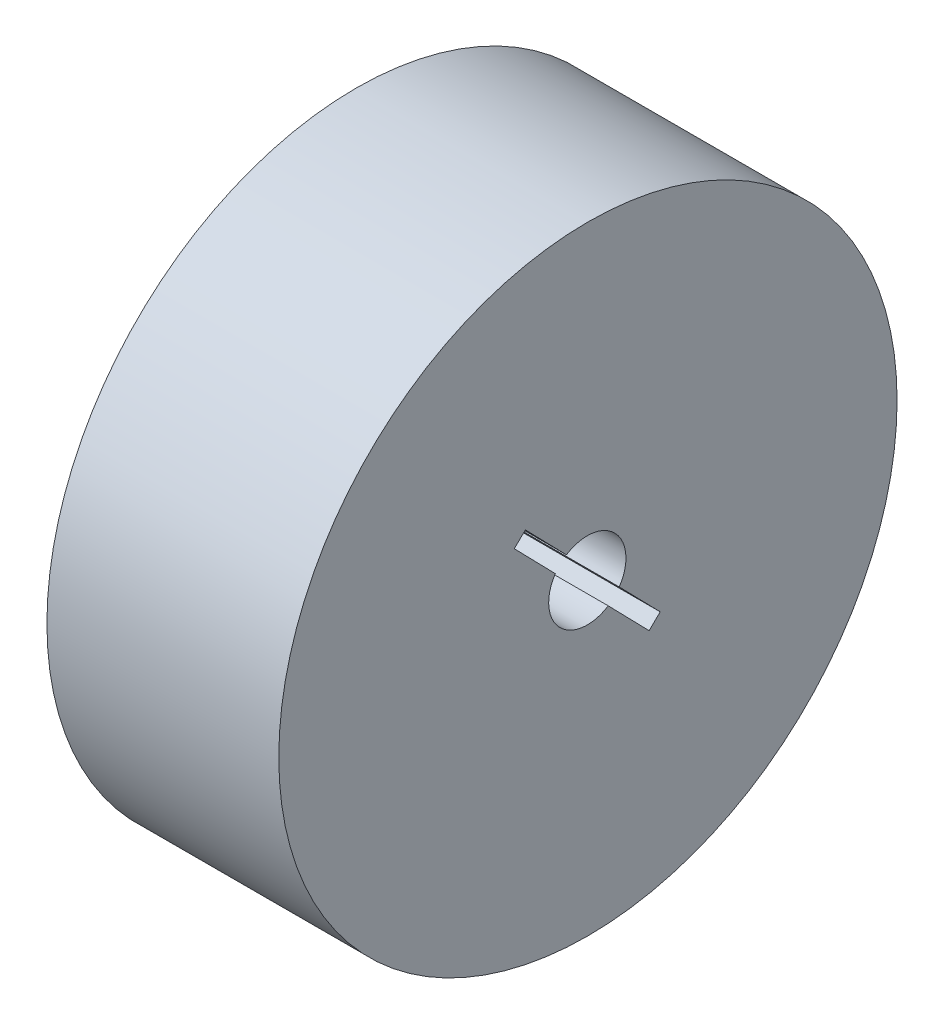
ISO-10303-21;
HEADER;
FILE_DESCRIPTION(('STEP AP214'),'2;1');
FILE_NAME('part.step','',(''),(''),'','','');
FILE_SCHEMA(('AUTOMOTIVE_DESIGN { 1 0 10303 214 1 1 1 1 }'));
ENDSEC;
DATA;
#1=APPLICATION_CONTEXT('core data for automotive mechanical design processes');
#2=APPLICATION_PROTOCOL_DEFINITION('international standard','automotive_design',2000,#1);
#3=PRODUCT_CONTEXT('',#1,'mechanical');
#4=PRODUCT('Part','Part','',(#3));
#5=PRODUCT_RELATED_PRODUCT_CATEGORY('part','',(#4));
#6=PRODUCT_DEFINITION_FORMATION('','',#4);
#7=PRODUCT_DEFINITION_CONTEXT('part definition',#1,'design');
#8=PRODUCT_DEFINITION('design','',#6,#7);
#9=PRODUCT_DEFINITION_SHAPE('','',#8);
#10=(LENGTH_UNIT() NAMED_UNIT(*) SI_UNIT(.MILLI.,.METRE.));
#11=(NAMED_UNIT(*) PLANE_ANGLE_UNIT() SI_UNIT($,.RADIAN.));
#12=(NAMED_UNIT(*) SI_UNIT($,.STERADIAN.) SOLID_ANGLE_UNIT());
#13=UNCERTAINTY_MEASURE_WITH_UNIT(LENGTH_MEASURE(1.E-05),#10,'distance_accuracy_value','');
#14=(GEOMETRIC_REPRESENTATION_CONTEXT(3) GLOBAL_UNCERTAINTY_ASSIGNED_CONTEXT((#13)) GLOBAL_UNIT_ASSIGNED_CONTEXT((#10,
#11,#12)) REPRESENTATION_CONTEXT('',''));
#15=CARTESIAN_POINT('',(0.,0.,0.));
#16=DIRECTION('',(0.,0.,1.));
#17=DIRECTION('',(1.,0.,0.));
#18=AXIS2_PLACEMENT_3D('',#15,#16,#17);
#19=CARTESIAN_POINT('',(30.,0.,0.));
#20=DIRECTION('',(1.,0.,0.));
#21=DIRECTION('',(0.,0.,-1.));
#22=AXIS2_PLACEMENT_3D('',#19,#20,#21);
#23=PLANE('',#22);
#24=CARTESIAN_POINT('',(30.,0.,0.));
#25=DIRECTION('',(1.,0.,0.));
#26=DIRECTION('',(0.,0.,-1.));
#27=AXIS2_PLACEMENT_3D('',#24,#25,#26);
#28=CIRCLE('',#27,40.);
#29=CARTESIAN_POINT('',(30.,0.,-40.));
#30=VERTEX_POINT('',#29);
#31=EDGE_CURVE('E13',#30,#30,#28,.T.);
#32=ORIENTED_EDGE('',*,*,#31,.T.);
#33=EDGE_LOOP('',(#32));
#34=FACE_BOUND('',#33,.T.);
#35=DIRECTION('',(0.,0.716251170960311,0.697842575440897));
#36=VECTOR('',#35,1.);
#37=CARTESIAN_POINT('',(30.,4.09215275080594,2.78138807200051));
#38=LINE('',#37,#36);
#39=CARTESIAN_POINT('',(30.,4.09215275080594,2.78138807200051));
#40=VERTEX_POINT('',#39);
#41=CARTESIAN_POINT('',(30.,9.5458926469176,8.09495969211338));
#42=VERTEX_POINT('',#41);
#43=EDGE_CURVE('E119',#40,#42,#38,.T.);
#44=ORIENTED_EDGE('',*,*,#43,.F.);
#45=CARTESIAN_POINT('',(30.,-0.115213187635466,0.0798936966514008));
#46=DIRECTION('',(1.,0.,0.));
#47=DIRECTION('',(0.,0.,-1.));
#48=AXIS2_PLACEMENT_3D('',#45,#46,#47);
#49=CIRCLE('',#48,5.);
#50=CARTESIAN_POINT('',(30.,-2.92531605178052,-4.05572256854098));
#51=VERTEX_POINT('',#50);
#52=EDGE_CURVE('E111',#51,#40,#49,.T.);
#53=ORIENTED_EDGE('',*,*,#52,.F.);
#54=DIRECTION('',(0.,0.716251170960311,0.697842575440897));
#55=VECTOR('',#54,1.);
#56=CARTESIAN_POINT('',(30.,-8.36038662709018,-9.35110469390904));
#57=LINE('',#56,#55);
#58=CARTESIAN_POINT('',(30.,-8.36038662709018,-9.35110469390904));
#59=VERTEX_POINT('',#58);
#60=EDGE_CURVE('E143',#59,#51,#57,.T.);
#61=ORIENTED_EDGE('',*,*,#60,.F.);
#62=DIRECTION('',(0.,0.697842575440896,-0.716251170960312));
#63=VECTOR('',#62,1.);
#64=CARTESIAN_POINT('',(30.,-9.75607177797197,-7.91860235198832));
#65=LINE('',#64,#63);
#66=CARTESIAN_POINT('',(30.,-9.75607177797197,-7.91860235198832));
#67=VERTEX_POINT('',#66);
#68=EDGE_CURVE('E141',#67,#59,#65,.T.);
#69=ORIENTED_EDGE('',*,*,#68,.F.);
#70=DIRECTION('',(0.,-0.716251170960311,-0.697842575440897));
#71=VECTOR('',#70,1.);
#72=CARTESIAN_POINT('',(30.,-4.32133179150684,-2.6235423188975));
#73=LINE('',#72,#71);
#74=CARTESIAN_POINT('',(30.,-4.32133179150684,-2.6235423188975));
#75=VERTEX_POINT('',#74);
#76=EDGE_CURVE('E139',#75,#67,#73,.T.);
#77=ORIENTED_EDGE('',*,*,#76,.F.);
#78=CARTESIAN_POINT('',(30.,-0.115213187635466,0.0798936966514008));
#79=DIRECTION('',(1.,0.,0.));
#80=DIRECTION('',(0.,0.,-1.));
#81=AXIS2_PLACEMENT_3D('',#78,#79,#80);
#82=CIRCLE('',#81,5.);
#83=CARTESIAN_POINT('',(30.,2.69679818876869,4.21421250619836));
#84=VERTEX_POINT('',#83);
#85=EDGE_CURVE('E137',#84,#75,#82,.T.);
#86=ORIENTED_EDGE('',*,*,#85,.F.);
#87=DIRECTION('',(0.,-0.716251170960311,-0.697842575440897));
#88=VECTOR('',#87,1.);
#89=CARTESIAN_POINT('',(30.,8.15020749603582,9.52746203403398));
#90=LINE('',#89,#88);
#91=CARTESIAN_POINT('',(30.,8.15020749603582,9.52746203403398));
#92=VERTEX_POINT('',#91);
#93=EDGE_CURVE('E133',#92,#84,#90,.T.);
#94=ORIENTED_EDGE('',*,*,#93,.F.);
#95=DIRECTION('',(0.,-0.697842575440897,0.716251170960311));
#96=VECTOR('',#95,1.);
#97=CARTESIAN_POINT('',(30.,9.5458926469176,8.09495969211338));
#98=LINE('',#97,#96);
#99=EDGE_CURVE('E131',#42,#92,#98,.T.);
#100=ORIENTED_EDGE('',*,*,#99,.F.);
#101=EDGE_LOOP('',(#44,#53,#61,#69,#77,#86,#94,#100));
#102=FACE_BOUND('',#101,.T.);
#103=ADVANCED_FACE('F46',(#34,#102),#23,.T.);
#104=CARTESIAN_POINT('',(0.,0.,0.));
#105=DIRECTION('',(1.,0.,0.));
#106=DIRECTION('',(0.,0.,-1.));
#107=AXIS2_PLACEMENT_3D('',#104,#105,#106);
#108=PLANE('',#107);
#109=CARTESIAN_POINT('',(0.,0.,0.));
#110=DIRECTION('',(1.,0.,0.));
#111=DIRECTION('',(0.,0.,-1.));
#112=AXIS2_PLACEMENT_3D('',#109,#110,#111);
#113=CIRCLE('',#112,40.);
#114=CARTESIAN_POINT('',(0.,0.,-40.));
#115=VERTEX_POINT('',#114);
#116=EDGE_CURVE('E50',#115,#115,#113,.T.);
#117=ORIENTED_EDGE('',*,*,#116,.F.);
#118=EDGE_LOOP('',(#117));
#119=FACE_BOUND('',#118,.T.);
#120=CARTESIAN_POINT('',(0.,-0.115213187635445,0.0798936966514563));
#121=DIRECTION('',(1.,0.,0.));
#122=DIRECTION('',(0.,0.,-1.));
#123=AXIS2_PLACEMENT_3D('',#120,#121,#122);
#124=CIRCLE('',#123,5.);
#125=CARTESIAN_POINT('',(0.,-2.92531605178052,-4.05572256854098));
#126=VERTEX_POINT('',#125);
#127=CARTESIAN_POINT('',(0.,4.09215275080594,2.78138807200051));
#128=VERTEX_POINT('',#127);
#129=EDGE_CURVE('E69',#126,#128,#124,.T.);
#130=ORIENTED_EDGE('',*,*,#129,.T.);
#131=DIRECTION('',(0.,0.716251170960311,0.697842575440897));
#132=VECTOR('',#131,1.);
#133=CARTESIAN_POINT('',(0.,4.09215275080594,2.78138807200051));
#134=LINE('',#133,#132);
#135=CARTESIAN_POINT('',(0.,9.54589264691759,8.09495969211338));
#136=VERTEX_POINT('',#135);
#137=EDGE_CURVE('E126',#128,#136,#134,.T.);
#138=ORIENTED_EDGE('',*,*,#137,.T.);
#139=DIRECTION('',(0.,-0.697842575440897,0.716251170960311));
#140=VECTOR('',#139,1.);
#141=CARTESIAN_POINT('',(0.,9.54589264691759,8.09495969211338));
#142=LINE('',#141,#140);
#143=CARTESIAN_POINT('',(0.,8.15020749603582,9.52746203403398));
#144=VERTEX_POINT('',#143);
#145=EDGE_CURVE('E147',#136,#144,#142,.T.);
#146=ORIENTED_EDGE('',*,*,#145,.T.);
#147=DIRECTION('',(0.,-0.716251170960311,-0.697842575440897));
#148=VECTOR('',#147,1.);
#149=CARTESIAN_POINT('',(0.,8.15020749603582,9.52746203403398));
#150=LINE('',#149,#148);
#151=CARTESIAN_POINT('',(0.,2.69679818876867,4.21421250619836));
#152=VERTEX_POINT('',#151);
#153=EDGE_CURVE('E150',#144,#152,#150,.T.);
#154=ORIENTED_EDGE('',*,*,#153,.T.);
#155=CARTESIAN_POINT('',(0.,-0.115213187635445,0.0798936966514563));
#156=DIRECTION('',(1.,0.,0.));
#157=DIRECTION('',(0.,0.,-1.));
#158=AXIS2_PLACEMENT_3D('',#155,#156,#157);
#159=CIRCLE('',#158,5.);
#160=CARTESIAN_POINT('',(0.,-4.32133179150684,-2.6235423188975));
#161=VERTEX_POINT('',#160);
#162=EDGE_CURVE('E153',#152,#161,#159,.T.);
#163=ORIENTED_EDGE('',*,*,#162,.T.);
#164=DIRECTION('',(0.,-0.716251170960311,-0.697842575440897));
#165=VECTOR('',#164,1.);
#166=CARTESIAN_POINT('',(0.,-4.32133179150684,-2.6235423188975));
#167=LINE('',#166,#165);
#168=CARTESIAN_POINT('',(0.,-9.75607177797198,-7.91860235198832));
#169=VERTEX_POINT('',#168);
#170=EDGE_CURVE('E156',#161,#169,#167,.T.);
#171=ORIENTED_EDGE('',*,*,#170,.T.);
#172=DIRECTION('',(0.,0.697842575440896,-0.716251170960312));
#173=VECTOR('',#172,1.);
#174=CARTESIAN_POINT('',(0.,-9.75607177797198,-7.91860235198832));
#175=LINE('',#174,#173);
#176=CARTESIAN_POINT('',(0.,-8.36038662709018,-9.35110469390904));
#177=VERTEX_POINT('',#176);
#178=EDGE_CURVE('E159',#169,#177,#175,.T.);
#179=ORIENTED_EDGE('',*,*,#178,.T.);
#180=DIRECTION('',(0.,0.716251170960311,0.697842575440897));
#181=VECTOR('',#180,1.);
#182=CARTESIAN_POINT('',(0.,-8.36038662709018,-9.35110469390904));
#183=LINE('',#182,#181);
#184=EDGE_CURVE('E120',#177,#126,#183,.T.);
#185=ORIENTED_EDGE('',*,*,#184,.T.);
#186=EDGE_LOOP('',(#130,#138,#146,#154,#163,#171,#179,#185));
#187=FACE_BOUND('',#186,.T.);
#188=ADVANCED_FACE('F180',(#119,#187),#108,.F.);
#189=CARTESIAN_POINT('',(30.,0.,0.));
#190=DIRECTION('',(-1.,0.,0.));
#191=DIRECTION('',(0.,0.,1.));
#192=AXIS2_PLACEMENT_3D('',#189,#190,#191);
#193=CYLINDRICAL_SURFACE('',#192,40.);
#194=ORIENTED_EDGE('',*,*,#31,.F.);
#195=EDGE_LOOP('',(#194));
#196=FACE_BOUND('',#195,.T.);
#197=ORIENTED_EDGE('',*,*,#116,.T.);
#198=EDGE_LOOP('',(#197));
#199=FACE_BOUND('',#198,.T.);
#200=ADVANCED_FACE('F48',(#196,#199),#193,.T.);
#201=CARTESIAN_POINT('',(30.,-0.115213187635466,0.0798936966514008));
#202=DIRECTION('',(-1.,0.,0.));
#203=DIRECTION('',(0.,0.,1.));
#204=AXIS2_PLACEMENT_3D('',#201,#202,#203);
#205=CYLINDRICAL_SURFACE('',#204,5.);
#206=ORIENTED_EDGE('',*,*,#129,.F.);
#207=DIRECTION('',(-1.,0.,0.));
#208=VECTOR('',#207,1.);
#209=CARTESIAN_POINT('',(30.,-2.92531605178052,-4.05572256854098));
#210=LINE('',#209,#208);
#211=EDGE_CURVE('E115',#51,#126,#210,.T.);
#212=ORIENTED_EDGE('',*,*,#211,.F.);
#213=ORIENTED_EDGE('',*,*,#52,.T.);
#214=DIRECTION('',(-1.,0.,0.));
#215=VECTOR('',#214,1.);
#216=CARTESIAN_POINT('',(30.,4.09215275080594,2.78138807200051));
#217=LINE('',#216,#215);
#218=EDGE_CURVE('E114',#40,#128,#217,.T.);
#219=ORIENTED_EDGE('',*,*,#218,.T.);
#220=EDGE_LOOP('',(#206,#212,#213,#219));
#221=FACE_BOUND('',#220,.T.);
#222=ADVANCED_FACE('F113',(#221),#205,.F.);
#223=CARTESIAN_POINT('',(30.,4.09215275080594,2.78138807200051));
#224=DIRECTION('',(0.,-0.697842575440897,0.716251170960311));
#225=DIRECTION('',(0.,-0.716251170960311,-0.697842575440897));
#226=AXIS2_PLACEMENT_3D('',#223,#224,#225);
#227=PLANE('',#226);
#228=ORIENTED_EDGE('',*,*,#137,.F.);
#229=ORIENTED_EDGE('',*,*,#218,.F.);
#230=ORIENTED_EDGE('',*,*,#43,.T.);
#231=DIRECTION('',(-1.,0.,0.));
#232=VECTOR('',#231,1.);
#233=CARTESIAN_POINT('',(30.,9.5458926469176,8.09495969211338));
#234=LINE('',#233,#232);
#235=EDGE_CURVE('E127',#42,#136,#234,.T.);
#236=ORIENTED_EDGE('',*,*,#235,.T.);
#237=EDGE_LOOP('',(#228,#229,#230,#236));
#238=FACE_BOUND('',#237,.T.);
#239=ADVANCED_FACE('F123',(#238),#227,.T.);
#240=CARTESIAN_POINT('',(30.,9.5458926469176,8.09495969211338));
#241=DIRECTION('',(0.,-0.716251170960311,-0.697842575440897));
#242=DIRECTION('',(0.,0.697842575440897,-0.716251170960311));
#243=AXIS2_PLACEMENT_3D('',#240,#241,#242);
#244=PLANE('',#243);
#245=ORIENTED_EDGE('',*,*,#145,.F.);
#246=ORIENTED_EDGE('',*,*,#235,.F.);
#247=ORIENTED_EDGE('',*,*,#99,.T.);
#248=DIRECTION('',(-1.,0.,0.));
#249=VECTOR('',#248,1.);
#250=CARTESIAN_POINT('',(30.,8.15020749603582,9.52746203403398));
#251=LINE('',#250,#249);
#252=EDGE_CURVE('E172',#92,#144,#251,.T.);
#253=ORIENTED_EDGE('',*,*,#252,.T.);
#254=EDGE_LOOP('',(#245,#246,#247,#253));
#255=FACE_BOUND('',#254,.T.);
#256=ADVANCED_FACE('F176',(#255),#244,.T.);
#257=CARTESIAN_POINT('',(30.,8.15020749603582,9.52746203403398));
#258=DIRECTION('',(0.,0.697842575440897,-0.716251170960311));
#259=DIRECTION('',(0.,0.716251170960311,0.697842575440897));
#260=AXIS2_PLACEMENT_3D('',#257,#258,#259);
#261=PLANE('',#260);
#262=ORIENTED_EDGE('',*,*,#153,.F.);
#263=ORIENTED_EDGE('',*,*,#252,.F.);
#264=ORIENTED_EDGE('',*,*,#93,.T.);
#265=DIRECTION('',(-1.,0.,0.));
#266=VECTOR('',#265,1.);
#267=CARTESIAN_POINT('',(30.,2.69679818876869,4.21421250619836));
#268=LINE('',#267,#266);
#269=EDGE_CURVE('E170',#84,#152,#268,.T.);
#270=ORIENTED_EDGE('',*,*,#269,.T.);
#271=EDGE_LOOP('',(#262,#263,#264,#270));
#272=FACE_BOUND('',#271,.T.);
#273=ADVANCED_FACE('F198',(#272),#261,.T.);
#274=CARTESIAN_POINT('',(30.,-0.115213187635466,0.0798936966514008));
#275=DIRECTION('',(-1.,0.,0.));
#276=DIRECTION('',(0.,0.,1.));
#277=AXIS2_PLACEMENT_3D('',#274,#275,#276);
#278=CYLINDRICAL_SURFACE('',#277,5.);
#279=ORIENTED_EDGE('',*,*,#162,.F.);
#280=ORIENTED_EDGE('',*,*,#269,.F.);
#281=ORIENTED_EDGE('',*,*,#85,.T.);
#282=DIRECTION('',(-1.,0.,0.));
#283=VECTOR('',#282,1.);
#284=CARTESIAN_POINT('',(30.,-4.32133179150684,-2.6235423188975));
#285=LINE('',#284,#283);
#286=EDGE_CURVE('E168',#75,#161,#285,.T.);
#287=ORIENTED_EDGE('',*,*,#286,.T.);
#288=EDGE_LOOP('',(#279,#280,#281,#287));
#289=FACE_BOUND('',#288,.T.);
#290=ADVANCED_FACE('F195',(#289),#278,.F.);
#291=CARTESIAN_POINT('',(30.,-4.32133179150684,-2.6235423188975));
#292=DIRECTION('',(0.,0.697842575440897,-0.716251170960311));
#293=DIRECTION('',(0.,0.716251170960311,0.697842575440897));
#294=AXIS2_PLACEMENT_3D('',#291,#292,#293);
#295=PLANE('',#294);
#296=ORIENTED_EDGE('',*,*,#170,.F.);
#297=ORIENTED_EDGE('',*,*,#286,.F.);
#298=ORIENTED_EDGE('',*,*,#76,.T.);
#299=DIRECTION('',(-1.,0.,0.));
#300=VECTOR('',#299,1.);
#301=CARTESIAN_POINT('',(30.,-9.75607177797197,-7.91860235198832));
#302=LINE('',#301,#300);
#303=EDGE_CURVE('E166',#67,#169,#302,.T.);
#304=ORIENTED_EDGE('',*,*,#303,.T.);
#305=EDGE_LOOP('',(#296,#297,#298,#304));
#306=FACE_BOUND('',#305,.T.);
#307=ADVANCED_FACE('F191',(#306),#295,.T.);
#308=CARTESIAN_POINT('',(30.,-9.75607177797197,-7.91860235198832));
#309=DIRECTION('',(0.,0.716251170960312,0.697842575440896));
#310=DIRECTION('',(0.,-0.697842575440896,0.716251170960312));
#311=AXIS2_PLACEMENT_3D('',#308,#309,#310);
#312=PLANE('',#311);
#313=ORIENTED_EDGE('',*,*,#178,.F.);
#314=ORIENTED_EDGE('',*,*,#303,.F.);
#315=ORIENTED_EDGE('',*,*,#68,.T.);
#316=DIRECTION('',(-1.,0.,0.));
#317=VECTOR('',#316,1.);
#318=CARTESIAN_POINT('',(30.,-8.36038662709018,-9.35110469390904));
#319=LINE('',#318,#317);
#320=EDGE_CURVE('E61',#59,#177,#319,.T.);
#321=ORIENTED_EDGE('',*,*,#320,.T.);
#322=EDGE_LOOP('',(#313,#314,#315,#321));
#323=FACE_BOUND('',#322,.T.);
#324=ADVANCED_FACE('F188',(#323),#312,.T.);
#325=CARTESIAN_POINT('',(30.,-8.36038662709018,-9.35110469390904));
#326=DIRECTION('',(0.,-0.697842575440897,0.716251170960311));
#327=DIRECTION('',(0.,-0.716251170960311,-0.697842575440897));
#328=AXIS2_PLACEMENT_3D('',#325,#326,#327);
#329=PLANE('',#328);
#330=ORIENTED_EDGE('',*,*,#184,.F.);
#331=ORIENTED_EDGE('',*,*,#320,.F.);
#332=ORIENTED_EDGE('',*,*,#60,.T.);
#333=ORIENTED_EDGE('',*,*,#211,.T.);
#334=EDGE_LOOP('',(#330,#331,#332,#333));
#335=FACE_BOUND('',#334,.T.);
#336=ADVANCED_FACE('F182',(#335),#329,.T.);
#337=CLOSED_SHELL('',(#103,#188,#200,#222,#239,#256,#273,#290,#307,#324,#336));
#338=MANIFOLD_SOLID_BREP('B2',#337);
#339=ADVANCED_BREP_SHAPE_REPRESENTATION('',(#18,#338),#14);
#340=SHAPE_DEFINITION_REPRESENTATION(#9,#339);
ENDSEC;
END-ISO-10303-21;
